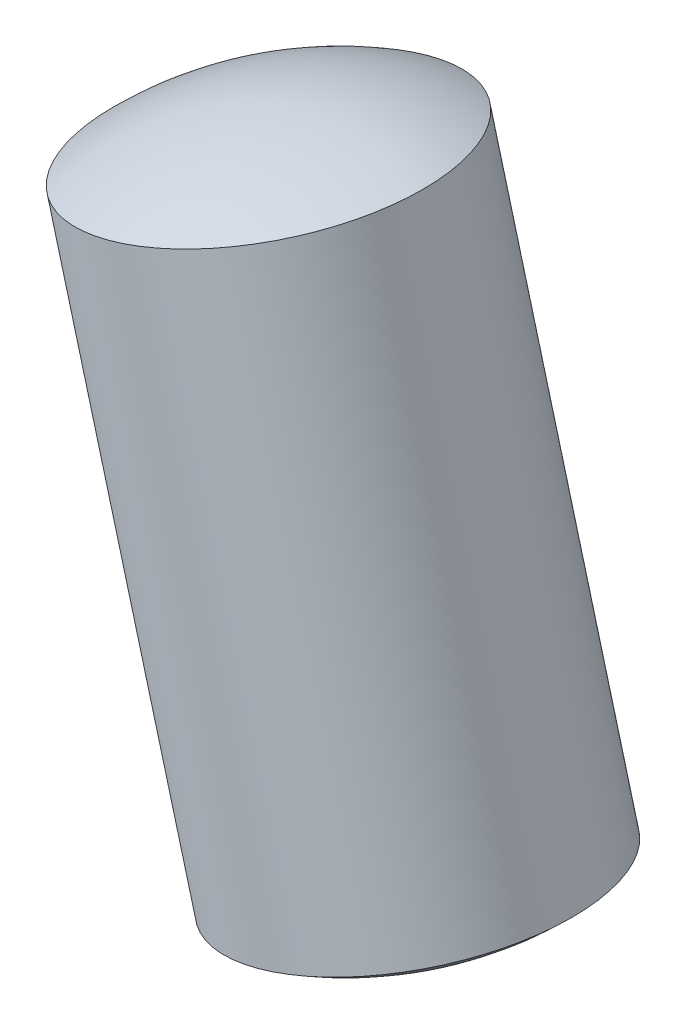
ISO-10303-21;
HEADER;
FILE_DESCRIPTION(('STEP AP214'),'2;1');
FILE_NAME('part.step','',(''),(''),'','','');
FILE_SCHEMA(('AUTOMOTIVE_DESIGN { 1 0 10303 214 1 1 1 1 }'));
ENDSEC;
DATA;
#1=APPLICATION_CONTEXT('core data for automotive mechanical design processes');
#2=APPLICATION_PROTOCOL_DEFINITION('international standard','automotive_design',2000,#1);
#3=PRODUCT_CONTEXT('',#1,'mechanical');
#4=PRODUCT('Part','Part','',(#3));
#5=PRODUCT_RELATED_PRODUCT_CATEGORY('part','',(#4));
#6=PRODUCT_DEFINITION_FORMATION('','',#4);
#7=PRODUCT_DEFINITION_CONTEXT('part definition',#1,'design');
#8=PRODUCT_DEFINITION('design','',#6,#7);
#9=PRODUCT_DEFINITION_SHAPE('','',#8);
#10=(LENGTH_UNIT() NAMED_UNIT(*) SI_UNIT(.MILLI.,.METRE.));
#11=(NAMED_UNIT(*) PLANE_ANGLE_UNIT() SI_UNIT($,.RADIAN.));
#12=(NAMED_UNIT(*) SI_UNIT($,.STERADIAN.) SOLID_ANGLE_UNIT());
#13=UNCERTAINTY_MEASURE_WITH_UNIT(LENGTH_MEASURE(1.E-05),#10,'distance_accuracy_value','');
#14=(GEOMETRIC_REPRESENTATION_CONTEXT(3) GLOBAL_UNCERTAINTY_ASSIGNED_CONTEXT((#13)) GLOBAL_UNIT_ASSIGNED_CONTEXT((#10,
#11,#12)) REPRESENTATION_CONTEXT('',''));
#15=CARTESIAN_POINT('',(0.,0.,0.));
#16=DIRECTION('',(0.,0.,1.));
#17=DIRECTION('',(1.,0.,0.));
#18=AXIS2_PLACEMENT_3D('',#15,#16,#17);
#19=CARTESIAN_POINT('',(-7.14390355797008,26.6614110427164,0.9));
#20=DIRECTION('',(0.965925826289068,0.258819045102521,0.));
#21=DIRECTION('',(-0.258819045102521,0.965925826289068,0.));
#22=AXIS2_PLACEMENT_3D('',#19,#20,#21);
#23=SPHERICAL_SURFACE('',#22,3.);
#24=CARTESIAN_POINT('',(-7.14390355797008,26.6614110427164,0.9));
#25=DIRECTION('',(0.258819045102521,-0.965925826289068,0.));
#26=DIRECTION('',(0.,0.,-1.));
#27=AXIS2_PLACEMENT_3D('',#24,#25,#26);
#28=SPHERICAL_SURFACE('',#27,3.);
#29=CARTESIAN_POINT('',(-7.81633516209612,29.17095995393,0.9));
#30=DIRECTION('',(0.258819045102521,-0.965925826289068,0.));
#31=DIRECTION('',(0.,0.,-1.));
#32=AXIS2_PLACEMENT_3D('',#29,#30,#31);
#33=CIRCLE('',#32,1.5);
#34=CARTESIAN_POINT('',(-7.81633516209612,29.17095995393,-0.6));
#35=VERTEX_POINT('',#34);
#36=EDGE_CURVE('E11',#35,#35,#33,.T.);
#37=ORIENTED_EDGE('',*,*,#36,.F.);
#38=EDGE_LOOP('',(#37));
#39=FACE_BOUND('',#38,.T.);
#40=ADVANCED_FACE('F17',(#39),#28,.T.);
#41=CARTESIAN_POINT('',(-7.09114392266854,26.4645094031823,0.9));
#42=DIRECTION('',(0.965925826289068,0.258819045102521,0.));
#43=DIRECTION('',(0.258819045102521,-0.965925826289068,0.));
#44=AXIS2_PLACEMENT_3D('',#41,#42,#43);
#45=SPHERICAL_SURFACE('',#44,3.);
#46=CARTESIAN_POINT('',(-7.09114392266854,26.4645094031823,0.9));
#47=DIRECTION('',(0.258819045102521,-0.965925826289068,0.));
#48=DIRECTION('',(0.,0.,-1.));
#49=AXIS2_PLACEMENT_3D('',#46,#47,#48);
#50=SPHERICAL_SURFACE('',#49,3.);
#51=CARTESIAN_POINT('',(-6.4187123185425,23.9549604919689,0.9));
#52=DIRECTION('',(0.258819045102521,-0.965925826289068,0.));
#53=DIRECTION('',(0.,0.,-1.));
#54=AXIS2_PLACEMENT_3D('',#51,#52,#53);
#55=CIRCLE('',#54,1.5);
#56=CARTESIAN_POINT('',(-6.4187123185425,23.9549604919689,-0.6));
#57=VERTEX_POINT('',#56);
#58=EDGE_CURVE('E20',#57,#57,#55,.T.);
#59=ORIENTED_EDGE('',*,*,#58,.T.);
#60=EDGE_LOOP('',(#59));
#61=FACE_BOUND('',#60,.T.);
#62=ADVANCED_FACE('F39',(#61),#50,.T.);
#63=CARTESIAN_POINT('',(-6.7681180294309,25.2589603574591,0.9));
#64=DIRECTION('',(0.258819045102521,-0.965925826289068,0.));
#65=DIRECTION('',(0.,0.,-1.));
#66=AXIS2_PLACEMENT_3D('',#63,#64,#65);
#67=CYLINDRICAL_SURFACE('',#66,1.5);
#68=ORIENTED_EDGE('',*,*,#36,.T.);
#69=EDGE_LOOP('',(#68));
#70=FACE_BOUND('',#69,.T.);
#71=ORIENTED_EDGE('',*,*,#58,.F.);
#72=EDGE_LOOP('',(#71));
#73=FACE_BOUND('',#72,.T.);
#74=ADVANCED_FACE('F47',(#70,#73),#67,.T.);
#75=CLOSED_SHELL('',(#40,#62,#74));
#76=MANIFOLD_SOLID_BREP('B1',#75);
#77=ADVANCED_BREP_SHAPE_REPRESENTATION('',(#18,#76),#14);
#78=SHAPE_DEFINITION_REPRESENTATION(#9,#77);
ENDSEC;
END-ISO-10303-21;
